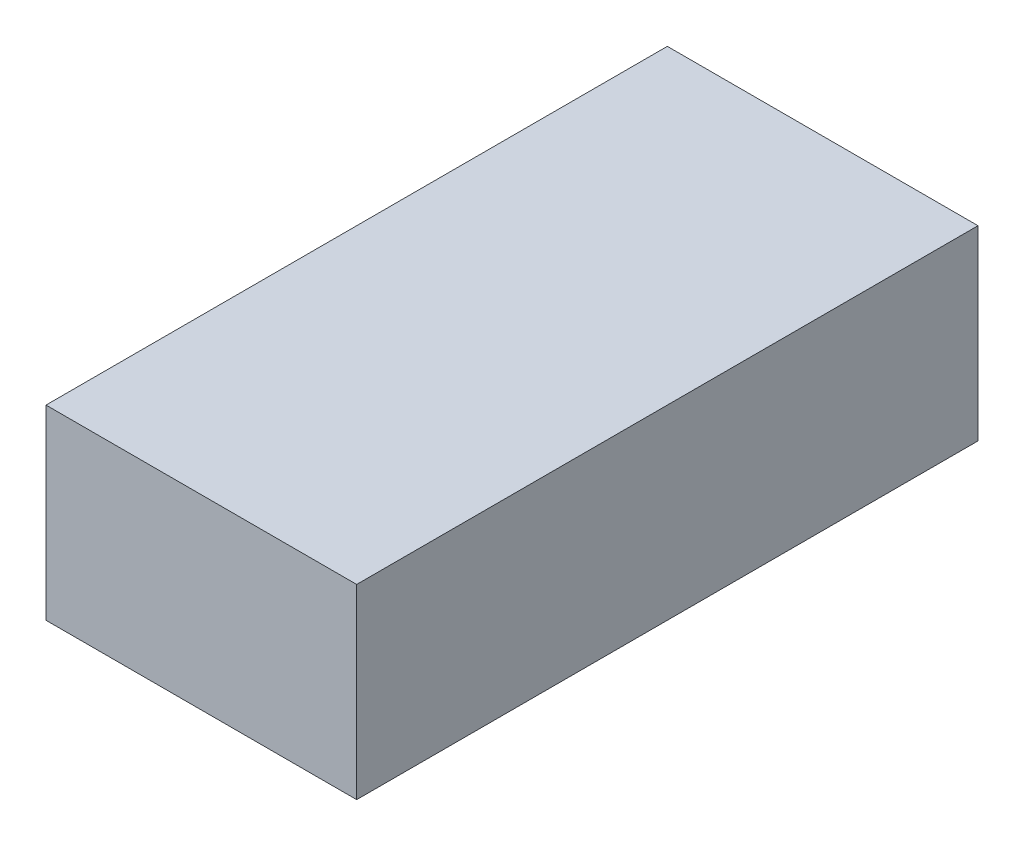
ISO-10303-21;
HEADER;
FILE_DESCRIPTION(('STEP AP214'),'2;1');
FILE_NAME('part.step','',(''),(''),'','','');
FILE_SCHEMA(('AUTOMOTIVE_DESIGN { 1 0 10303 214 1 1 1 1 }'));
ENDSEC;
DATA;
#1=APPLICATION_CONTEXT('core data for automotive mechanical design processes');
#2=APPLICATION_PROTOCOL_DEFINITION('international standard','automotive_design',2000,#1);
#3=PRODUCT_CONTEXT('',#1,'mechanical');
#4=PRODUCT('Part','Part','',(#3));
#5=PRODUCT_RELATED_PRODUCT_CATEGORY('part','',(#4));
#6=PRODUCT_DEFINITION_FORMATION('','',#4);
#7=PRODUCT_DEFINITION_CONTEXT('part definition',#1,'design');
#8=PRODUCT_DEFINITION('design','',#6,#7);
#9=PRODUCT_DEFINITION_SHAPE('','',#8);
#10=(LENGTH_UNIT() NAMED_UNIT(*) SI_UNIT(.MILLI.,.METRE.));
#11=(NAMED_UNIT(*) PLANE_ANGLE_UNIT() SI_UNIT($,.RADIAN.));
#12=(NAMED_UNIT(*) SI_UNIT($,.STERADIAN.) SOLID_ANGLE_UNIT());
#13=UNCERTAINTY_MEASURE_WITH_UNIT(LENGTH_MEASURE(1.E-05),#10,'distance_accuracy_value','');
#14=(GEOMETRIC_REPRESENTATION_CONTEXT(3) GLOBAL_UNCERTAINTY_ASSIGNED_CONTEXT((#13)) GLOBAL_UNIT_ASSIGNED_CONTEXT((#10,
#11,#12)) REPRESENTATION_CONTEXT('',''));
#15=CARTESIAN_POINT('',(0.,0.,0.));
#16=DIRECTION('',(0.,0.,1.));
#17=DIRECTION('',(1.,0.,0.));
#18=AXIS2_PLACEMENT_3D('',#15,#16,#17);
#19=CARTESIAN_POINT('',(2500.,-32.3,2272.51350251044));
#20=DIRECTION('',(0.,0.,-1.));
#21=DIRECTION('',(-1.,0.,0.));
#22=AXIS2_PLACEMENT_3D('',#19,#20,#21);
#23=PLANE('',#22);
#24=DIRECTION('',(0.,-1.,0.));
#25=VECTOR('',#24,1.);
#26=CARTESIAN_POINT('',(-2500.,-32.3,2272.51350251044));
#27=LINE('',#26,#25);
#28=CARTESIAN_POINT('',(-2500.,2967.7,2272.51350251044));
#29=VERTEX_POINT('',#28);
#30=CARTESIAN_POINT('',(-2500.,-32.3,2272.51350251044));
#31=VERTEX_POINT('',#30);
#32=EDGE_CURVE('E110',#29,#31,#27,.T.);
#33=ORIENTED_EDGE('',*,*,#32,.T.);
#34=DIRECTION('',(-1.,0.,0.));
#35=VECTOR('',#34,1.);
#36=CARTESIAN_POINT('',(2500.,-32.3,2272.51350251044));
#37=LINE('',#36,#35);
#38=CARTESIAN_POINT('',(2500.,-32.3,2272.51350251044));
#39=VERTEX_POINT('',#38);
#40=EDGE_CURVE('E12',#39,#31,#37,.T.);
#41=ORIENTED_EDGE('',*,*,#40,.F.);
#42=DIRECTION('',(0.,-1.,0.));
#43=VECTOR('',#42,1.);
#44=CARTESIAN_POINT('',(2500.,-32.3,2272.51350251044));
#45=LINE('',#44,#43);
#46=CARTESIAN_POINT('',(2500.,2967.7,2272.51350251044));
#47=VERTEX_POINT('',#46);
#48=EDGE_CURVE('E98',#47,#39,#45,.T.);
#49=ORIENTED_EDGE('',*,*,#48,.F.);
#50=DIRECTION('',(-1.,0.,0.));
#51=VECTOR('',#50,1.);
#52=CARTESIAN_POINT('',(2500.,2967.7,2272.51350251044));
#53=LINE('',#52,#51);
#54=EDGE_CURVE('E106',#47,#29,#53,.T.);
#55=ORIENTED_EDGE('',*,*,#54,.T.);
#56=EDGE_LOOP('',(#33,#41,#49,#55));
#57=FACE_BOUND('',#56,.T.);
#58=ADVANCED_FACE('F47',(#57),#23,.F.);
#59=CARTESIAN_POINT('',(2500.,-32.3,2272.51350251044));
#60=DIRECTION('',(0.,1.,0.));
#61=DIRECTION('',(0.,0.,1.));
#62=AXIS2_PLACEMENT_3D('',#59,#60,#61);
#63=PLANE('',#62);
#64=DIRECTION('',(0.,0.,-1.));
#65=VECTOR('',#64,1.);
#66=CARTESIAN_POINT('',(-2500.,-32.3,2272.51350251044));
#67=LINE('',#66,#65);
#68=CARTESIAN_POINT('',(-2500.,-32.3,-7727.48649748956));
#69=VERTEX_POINT('',#68);
#70=EDGE_CURVE('E102',#31,#69,#67,.T.);
#71=ORIENTED_EDGE('',*,*,#70,.T.);
#72=DIRECTION('',(-1.,0.,0.));
#73=VECTOR('',#72,1.);
#74=CARTESIAN_POINT('',(2500.,-32.3,-7727.48649748956));
#75=LINE('',#74,#73);
#76=CARTESIAN_POINT('',(2500.,-32.3,-7727.48649748956));
#77=VERTEX_POINT('',#76);
#78=EDGE_CURVE('E55',#77,#69,#75,.T.);
#79=ORIENTED_EDGE('',*,*,#78,.F.);
#80=DIRECTION('',(0.,0.,-1.));
#81=VECTOR('',#80,1.);
#82=CARTESIAN_POINT('',(2500.,-32.3,2272.51350251044));
#83=LINE('',#82,#81);
#84=EDGE_CURVE('E93',#39,#77,#83,.T.);
#85=ORIENTED_EDGE('',*,*,#84,.F.);
#86=ORIENTED_EDGE('',*,*,#40,.T.);
#87=EDGE_LOOP('',(#71,#79,#85,#86));
#88=FACE_BOUND('',#87,.T.);
#89=ADVANCED_FACE('F101',(#88),#63,.F.);
#90=CARTESIAN_POINT('',(2500.,-32.3,-7727.48649748956));
#91=DIRECTION('',(0.,0.,1.));
#92=DIRECTION('',(1.,0.,0.));
#93=AXIS2_PLACEMENT_3D('',#90,#91,#92);
#94=PLANE('',#93);
#95=DIRECTION('',(0.,1.,0.));
#96=VECTOR('',#95,1.);
#97=CARTESIAN_POINT('',(-2500.,-32.3,-7727.48649748956));
#98=LINE('',#97,#96);
#99=CARTESIAN_POINT('',(-2500.,2967.7,-7727.48649748956));
#100=VERTEX_POINT('',#99);
#101=EDGE_CURVE('E80',#69,#100,#98,.T.);
#102=ORIENTED_EDGE('',*,*,#101,.T.);
#103=DIRECTION('',(-1.,0.,0.));
#104=VECTOR('',#103,1.);
#105=CARTESIAN_POINT('',(2500.,2967.7,-7727.48649748956));
#106=LINE('',#105,#104);
#107=CARTESIAN_POINT('',(2500.,2967.7,-7727.48649748956));
#108=VERTEX_POINT('',#107);
#109=EDGE_CURVE('E103',#108,#100,#106,.T.);
#110=ORIENTED_EDGE('',*,*,#109,.F.);
#111=DIRECTION('',(0.,1.,0.));
#112=VECTOR('',#111,1.);
#113=CARTESIAN_POINT('',(2500.,-32.3,-7727.48649748956));
#114=LINE('',#113,#112);
#115=EDGE_CURVE('E96',#77,#108,#114,.T.);
#116=ORIENTED_EDGE('',*,*,#115,.F.);
#117=ORIENTED_EDGE('',*,*,#78,.T.);
#118=EDGE_LOOP('',(#102,#110,#116,#117));
#119=FACE_BOUND('',#118,.T.);
#120=ADVANCED_FACE('F104',(#119),#94,.F.);
#121=CARTESIAN_POINT('',(2500.,2967.7,2272.51350251044));
#122=DIRECTION('',(0.,-1.,0.));
#123=DIRECTION('',(0.,0.,-1.));
#124=AXIS2_PLACEMENT_3D('',#121,#122,#123);
#125=PLANE('',#124);
#126=DIRECTION('',(0.,0.,1.));
#127=VECTOR('',#126,1.);
#128=CARTESIAN_POINT('',(-2500.,2967.7,2272.51350251044));
#129=LINE('',#128,#127);
#130=EDGE_CURVE('E86',#100,#29,#129,.T.);
#131=ORIENTED_EDGE('',*,*,#130,.T.);
#132=ORIENTED_EDGE('',*,*,#54,.F.);
#133=DIRECTION('',(0.,0.,1.));
#134=VECTOR('',#133,1.);
#135=CARTESIAN_POINT('',(2500.,2967.7,2272.51350251044));
#136=LINE('',#135,#134);
#137=EDGE_CURVE('E63',#108,#47,#136,.T.);
#138=ORIENTED_EDGE('',*,*,#137,.F.);
#139=ORIENTED_EDGE('',*,*,#109,.T.);
#140=EDGE_LOOP('',(#131,#132,#138,#139));
#141=FACE_BOUND('',#140,.T.);
#142=ADVANCED_FACE('F117',(#141),#125,.F.);
#143=CARTESIAN_POINT('',(2500.,0.,0.));
#144=DIRECTION('',(-1.,0.,0.));
#145=DIRECTION('',(0.,0.,1.));
#146=AXIS2_PLACEMENT_3D('',#143,#144,#145);
#147=PLANE('',#146);
#148=ORIENTED_EDGE('',*,*,#48,.T.);
#149=ORIENTED_EDGE('',*,*,#84,.T.);
#150=ORIENTED_EDGE('',*,*,#115,.T.);
#151=ORIENTED_EDGE('',*,*,#137,.T.);
#152=EDGE_LOOP('',(#148,#149,#150,#151));
#153=FACE_BOUND('',#152,.T.);
#154=ADVANCED_FACE('F94',(#153),#147,.F.);
#155=CARTESIAN_POINT('',(-2500.,0.,0.));
#156=DIRECTION('',(-1.,0.,0.));
#157=DIRECTION('',(0.,0.,1.));
#158=AXIS2_PLACEMENT_3D('',#155,#156,#157);
#159=PLANE('',#158);
#160=ORIENTED_EDGE('',*,*,#32,.F.);
#161=ORIENTED_EDGE('',*,*,#130,.F.);
#162=ORIENTED_EDGE('',*,*,#101,.F.);
#163=ORIENTED_EDGE('',*,*,#70,.F.);
#164=EDGE_LOOP('',(#160,#161,#162,#163));
#165=FACE_BOUND('',#164,.T.);
#166=ADVANCED_FACE('F120',(#165),#159,.T.);
#167=CLOSED_SHELL('',(#58,#89,#120,#142,#154,#166));
#168=MANIFOLD_SOLID_BREP('B2_NOT_SHOWN',#167);
#169=CARTESIAN_POINT('',(69.,0.,0.));
#170=DIRECTION('',(0.,1.,0.));
#171=DIRECTION('',(0.,0.,1.));
#172=AXIS2_PLACEMENT_3D('',#169,#170,#171);
#173=PLANE('',#172);
#174=DIRECTION('',(-1.,0.,0.));
#175=VECTOR('',#174,1.);
#176=CARTESIAN_POINT('',(-48.6,0.,-92.6559396248703));
#177=LINE('',#176,#175);
#178=CARTESIAN_POINT('',(-48.6,0.,-92.6559396248703));
#179=VERTEX_POINT('',#178);
#180=CARTESIAN_POINT('',(-69.,0.,-92.6559396248703));
#181=VERTEX_POINT('',#180);
#182=EDGE_CURVE('E360',#179,#181,#177,.T.);
#183=ORIENTED_EDGE('',*,*,#182,.T.);
#184=DIRECTION('',(0.,0.,-1.));
#185=VECTOR('',#184,1.);
#186=CARTESIAN_POINT('',(-69.,0.,0.));
#187=LINE('',#186,#185);
#188=CARTESIAN_POINT('',(-69.,0.,-203.2));
#189=VERTEX_POINT('',#188);
#190=EDGE_CURVE('E344',#181,#189,#187,.T.);
#191=ORIENTED_EDGE('',*,*,#190,.T.);
#192=DIRECTION('',(-1.,0.,0.));
#193=VECTOR('',#192,1.);
#194=CARTESIAN_POINT('',(69.,0.,-203.2));
#195=LINE('',#194,#193);
#196=CARTESIAN_POINT('',(69.,0.,-203.2));
#197=VERTEX_POINT('',#196);
#198=EDGE_CURVE('E495',#197,#189,#195,.T.);
#199=ORIENTED_EDGE('',*,*,#198,.F.);
#200=DIRECTION('',(0.,0.,-1.));
#201=VECTOR('',#200,1.);
#202=CARTESIAN_POINT('',(69.,0.,262.79362659682));
#203=LINE('',#202,#201);
#204=CARTESIAN_POINT('',(69.,0.,-92.6559396248703));
#205=VERTEX_POINT('',#204);
#206=EDGE_CURVE('E444',#205,#197,#203,.T.);
#207=ORIENTED_EDGE('',*,*,#206,.F.);
#208=DIRECTION('',(1.,0.,0.));
#209=VECTOR('',#208,1.);
#210=CARTESIAN_POINT('',(48.6,0.,-92.6559396248703));
#211=LINE('',#210,#209);
#212=CARTESIAN_POINT('',(48.6,0.,-92.6559396248703));
#213=VERTEX_POINT('',#212);
#214=EDGE_CURVE('E397',#213,#205,#211,.T.);
#215=ORIENTED_EDGE('',*,*,#214,.F.);
#216=DIRECTION('',(0.,0.,1.));
#217=VECTOR('',#216,1.);
#218=CARTESIAN_POINT('',(48.6,0.,-28.0559396248703));
#219=LINE('',#218,#217);
#220=CARTESIAN_POINT('',(48.6,0.,-28.0559396248703));
#221=VERTEX_POINT('',#220);
#222=EDGE_CURVE('E394',#213,#221,#219,.T.);
#223=ORIENTED_EDGE('',*,*,#222,.T.);
#224=DIRECTION('',(1.,0.,0.));
#225=VECTOR('',#224,1.);
#226=CARTESIAN_POINT('',(48.6,0.,-28.0559396248703));
#227=LINE('',#226,#225);
#228=CARTESIAN_POINT('',(69.,0.,-28.0559396248703));
#229=VERTEX_POINT('',#228);
#230=EDGE_CURVE('E399',#221,#229,#227,.T.);
#231=ORIENTED_EDGE('',*,*,#230,.T.);
#232=CARTESIAN_POINT('',(69.,0.,160.34406037513));
#233=VERTEX_POINT('',#232);
#234=EDGE_CURVE('E450',#233,#229,#203,.T.);
#235=ORIENTED_EDGE('',*,*,#234,.F.);
#236=DIRECTION('',(1.,0.,0.));
#237=VECTOR('',#236,1.);
#238=CARTESIAN_POINT('',(48.6,0.,160.34406037513));
#239=LINE('',#238,#237);
#240=CARTESIAN_POINT('',(48.6,0.,160.34406037513));
#241=VERTEX_POINT('',#240);
#242=EDGE_CURVE('E410',#241,#233,#239,.T.);
#243=ORIENTED_EDGE('',*,*,#242,.F.);
#244=DIRECTION('',(0.,0.,1.));
#245=VECTOR('',#244,1.);
#246=CARTESIAN_POINT('',(48.6,0.,224.94406037513));
#247=LINE('',#246,#245);
#248=CARTESIAN_POINT('',(48.6,0.,224.94406037513));
#249=VERTEX_POINT('',#248);
#250=EDGE_CURVE('E407',#241,#249,#247,.T.);
#251=ORIENTED_EDGE('',*,*,#250,.T.);
#252=DIRECTION('',(1.,0.,0.));
#253=VECTOR('',#252,1.);
#254=CARTESIAN_POINT('',(48.6,0.,224.94406037513));
#255=LINE('',#254,#253);
#256=CARTESIAN_POINT('',(69.,0.,224.94406037513));
#257=VERTEX_POINT('',#256);
#258=EDGE_CURVE('E412',#249,#257,#255,.T.);
#259=ORIENTED_EDGE('',*,*,#258,.T.);
#260=CARTESIAN_POINT('',(69.,0.,262.79362659682));
#261=VERTEX_POINT('',#260);
#262=EDGE_CURVE('E446',#261,#257,#203,.T.);
#263=ORIENTED_EDGE('',*,*,#262,.F.);
#264=DIRECTION('',(-1.,0.,0.));
#265=VECTOR('',#264,1.);
#266=CARTESIAN_POINT('',(69.,0.,262.79362659682));
#267=LINE('',#266,#265);
#268=CARTESIAN_POINT('',(-69.,0.,262.79362659682));
#269=VERTEX_POINT('',#268);
#270=EDGE_CURVE('E497',#261,#269,#267,.T.);
#271=ORIENTED_EDGE('',*,*,#270,.T.);
#272=CARTESIAN_POINT('',(-69.,0.,224.94406037513));
#273=VERTEX_POINT('',#272);
#274=EDGE_CURVE('E358',#269,#273,#187,.T.);
#275=ORIENTED_EDGE('',*,*,#274,.T.);
#276=DIRECTION('',(-1.,0.,0.));
#277=VECTOR('',#276,1.);
#278=CARTESIAN_POINT('',(-48.6,0.,224.94406037513));
#279=LINE('',#278,#277);
#280=CARTESIAN_POINT('',(-48.6,0.,224.94406037513));
#281=VERTEX_POINT('',#280);
#282=EDGE_CURVE('E383',#281,#273,#279,.T.);
#283=ORIENTED_EDGE('',*,*,#282,.F.);
#284=DIRECTION('',(0.,0.,1.));
#285=VECTOR('',#284,1.);
#286=CARTESIAN_POINT('',(-48.6,0.,224.94406037513));
#287=LINE('',#286,#285);
#288=CARTESIAN_POINT('',(-48.6,0.,160.34406037513));
#289=VERTEX_POINT('',#288);
#290=EDGE_CURVE('E380',#289,#281,#287,.T.);
#291=ORIENTED_EDGE('',*,*,#290,.F.);
#292=DIRECTION('',(-1.,0.,0.));
#293=VECTOR('',#292,1.);
#294=CARTESIAN_POINT('',(-48.6,0.,160.34406037513));
#295=LINE('',#294,#293);
#296=CARTESIAN_POINT('',(-69.,0.,160.34406037513));
#297=VERTEX_POINT('',#296);
#298=EDGE_CURVE('E386',#289,#297,#295,.T.);
#299=ORIENTED_EDGE('',*,*,#298,.T.);
#300=CARTESIAN_POINT('',(-69.,0.,-28.0559396248702));
#301=VERTEX_POINT('',#300);
#302=EDGE_CURVE('E355',#297,#301,#187,.T.);
#303=ORIENTED_EDGE('',*,*,#302,.T.);
#304=DIRECTION('',(-1.,0.,0.));
#305=VECTOR('',#304,1.);
#306=CARTESIAN_POINT('',(-48.6,0.,-28.0559396248703));
#307=LINE('',#306,#305);
#308=CARTESIAN_POINT('',(-48.6,0.,-28.0559396248703));
#309=VERTEX_POINT('',#308);
#310=EDGE_CURVE('E367',#309,#301,#307,.T.);
#311=ORIENTED_EDGE('',*,*,#310,.F.);
#312=DIRECTION('',(0.,0.,1.));
#313=VECTOR('',#312,1.);
#314=CARTESIAN_POINT('',(-48.6,0.,-28.0559396248703));
#315=LINE('',#314,#313);
#316=EDGE_CURVE('E362',#179,#309,#315,.T.);
#317=ORIENTED_EDGE('',*,*,#316,.F.);
#318=EDGE_LOOP('',(#183,#191,#199,#207,#215,#223,#231,#235,#243,#251,#259,#263,#271,#275,#283,
#291,#299,#303,#311,#317));
#319=FACE_BOUND('',#318,.T.);
#320=ADVANCED_FACE('F171',(#319),#173,.F.);
#321=CARTESIAN_POINT('',(69.,81.9,-188.2));
#322=DIRECTION('',(0.,0.,-1.));
#323=DIRECTION('',(-1.,0.,0.));
#324=AXIS2_PLACEMENT_3D('',#321,#322,#323);
#325=PLANE('',#324);
#326=DIRECTION('',(-1.,0.,0.));
#327=VECTOR('',#326,1.);
#328=CARTESIAN_POINT('',(69.,81.9,-188.2));
#329=LINE('',#328,#327);
#330=CARTESIAN_POINT('',(54.,81.9,-188.2));
#331=VERTEX_POINT('',#330);
#332=CARTESIAN_POINT('',(-54.,81.9,-188.2));
#333=VERTEX_POINT('',#332);
#334=EDGE_CURVE('E490',#331,#333,#329,.T.);
#335=ORIENTED_EDGE('',*,*,#334,.T.);
#336=DIRECTION('',(0.,-1.,0.));
#337=VECTOR('',#336,1.);
#338=CARTESIAN_POINT('',(-54.,270.696822007152,-188.2));
#339=LINE('',#338,#337);
#340=CARTESIAN_POINT('',(-54.,20.,-188.2));
#341=VERTEX_POINT('',#340);
#342=EDGE_CURVE('E427',#333,#341,#339,.T.);
#343=ORIENTED_EDGE('',*,*,#342,.T.);
#344=DIRECTION('',(-1.,0.,0.));
#345=VECTOR('',#344,1.);
#346=CARTESIAN_POINT('',(69.,20.,-188.2));
#347=LINE('',#346,#345);
#348=CARTESIAN_POINT('',(54.,20.,-188.2));
#349=VERTEX_POINT('',#348);
#350=EDGE_CURVE('E487',#349,#341,#347,.T.);
#351=ORIENTED_EDGE('',*,*,#350,.F.);
#352=DIRECTION('',(0.,-1.,0.));
#353=VECTOR('',#352,1.);
#354=CARTESIAN_POINT('',(54.,270.696822007152,-188.2));
#355=LINE('',#354,#353);
#356=EDGE_CURVE('E438',#331,#349,#355,.T.);
#357=ORIENTED_EDGE('',*,*,#356,.F.);
#358=EDGE_LOOP('',(#335,#343,#351,#357));
#359=FACE_BOUND('',#358,.T.);
#360=ADVANCED_FACE('F612',(#359),#325,.F.);
#361=CARTESIAN_POINT('',(69.,20.,-188.2));
#362=DIRECTION('',(0.,-1.,0.));
#363=DIRECTION('',(0.,0.,-1.));
#364=AXIS2_PLACEMENT_3D('',#361,#362,#363);
#365=PLANE('',#364);
#366=ORIENTED_EDGE('',*,*,#350,.T.);
#367=DIRECTION('',(0.,0.,1.));
#368=VECTOR('',#367,1.);
#369=CARTESIAN_POINT('',(-54.,20.,0.));
#370=LINE('',#369,#368);
#371=CARTESIAN_POINT('',(-54.,20.,0.));
#372=VERTEX_POINT('',#371);
#373=EDGE_CURVE('E415',#341,#372,#370,.T.);
#374=ORIENTED_EDGE('',*,*,#373,.T.);
#375=DIRECTION('',(-1.,0.,0.));
#376=VECTOR('',#375,1.);
#377=CARTESIAN_POINT('',(69.,20.,0.));
#378=LINE('',#377,#376);
#379=CARTESIAN_POINT('',(54.,20.,0.));
#380=VERTEX_POINT('',#379);
#381=EDGE_CURVE('E467',#380,#372,#378,.T.);
#382=ORIENTED_EDGE('',*,*,#381,.F.);
#383=DIRECTION('',(0.,0.,1.));
#384=VECTOR('',#383,1.);
#385=CARTESIAN_POINT('',(54.,20.,0.));
#386=LINE('',#385,#384);
#387=EDGE_CURVE('E425',#349,#380,#386,.T.);
#388=ORIENTED_EDGE('',*,*,#387,.F.);
#389=EDGE_LOOP('',(#366,#374,#382,#388));
#390=FACE_BOUND('',#389,.T.);
#391=ADVANCED_FACE('F617',(#390),#365,.F.);
#392=CARTESIAN_POINT('',(69.,20.,0.));
#393=DIRECTION('',(0.,0.,1.));
#394=DIRECTION('',(1.,0.,0.));
#395=AXIS2_PLACEMENT_3D('',#392,#393,#394);
#396=PLANE('',#395);
#397=DIRECTION('',(0.,1.,0.));
#398=VECTOR('',#397,1.);
#399=CARTESIAN_POINT('',(-69.,20.,0.));
#400=LINE('',#399,#398);
#401=CARTESIAN_POINT('',(-69.,81.9000000000001,0.));
#402=VERTEX_POINT('',#401);
#403=CARTESIAN_POINT('',(-69.,123.7,0.));
#404=VERTEX_POINT('',#403);
#405=EDGE_CURVE('E472',#402,#404,#400,.T.);
#406=ORIENTED_EDGE('',*,*,#405,.T.);
#407=DIRECTION('',(-1.,0.,0.));
#408=VECTOR('',#407,1.);
#409=CARTESIAN_POINT('',(69.,123.7,0.));
#410=LINE('',#409,#408);
#411=CARTESIAN_POINT('',(69.,123.7,0.));
#412=VERTEX_POINT('',#411);
#413=EDGE_CURVE('E519',#404,#412,#410,.F.);
#414=ORIENTED_EDGE('',*,*,#413,.T.);
#415=DIRECTION('',(0.,1.,0.));
#416=VECTOR('',#415,1.);
#417=CARTESIAN_POINT('',(69.,20.,0.));
#418=LINE('',#417,#416);
#419=CARTESIAN_POINT('',(69.,81.9000000000002,0.));
#420=VERTEX_POINT('',#419);
#421=EDGE_CURVE('E454',#420,#412,#418,.T.);
#422=ORIENTED_EDGE('',*,*,#421,.F.);
#423=DIRECTION('',(-1.,0.,0.));
#424=VECTOR('',#423,1.);
#425=CARTESIAN_POINT('',(69.,81.9000000000002,0.));
#426=LINE('',#425,#424);
#427=CARTESIAN_POINT('',(54.,81.9000000000002,0.));
#428=VERTEX_POINT('',#427);
#429=EDGE_CURVE('E433',#420,#428,#426,.T.);
#430=ORIENTED_EDGE('',*,*,#429,.T.);
#431=DIRECTION('',(0.,-1.,0.));
#432=VECTOR('',#431,1.);
#433=CARTESIAN_POINT('',(54.,270.696822007151,0.));
#434=LINE('',#433,#432);
#435=EDGE_CURVE('E435',#428,#380,#434,.T.);
#436=ORIENTED_EDGE('',*,*,#435,.T.);
#437=ORIENTED_EDGE('',*,*,#381,.T.);
#438=DIRECTION('',(0.,-1.,0.));
#439=VECTOR('',#438,1.);
#440=CARTESIAN_POINT('',(-54.,270.696822007151,0.));
#441=LINE('',#440,#439);
#442=CARTESIAN_POINT('',(-54.,81.9000000000002,0.));
#443=VERTEX_POINT('',#442);
#444=EDGE_CURVE('E422',#443,#372,#441,.T.);
#445=ORIENTED_EDGE('',*,*,#444,.F.);
#446=DIRECTION('',(1.,0.,0.));
#447=VECTOR('',#446,1.);
#448=CARTESIAN_POINT('',(-69.,81.9000000000002,0.));
#449=LINE('',#448,#447);
#450=EDGE_CURVE('E421',#402,#443,#449,.T.);
#451=ORIENTED_EDGE('',*,*,#450,.F.);
#452=EDGE_LOOP('',(#406,#414,#422,#430,#436,#437,#445,#451));
#453=FACE_BOUND('',#452,.T.);
#454=ADVANCED_FACE('F625',(#453),#396,.F.);
#455=CARTESIAN_POINT('',(69.,15.7395723137565,255.14406037513));
#456=DIRECTION('',(-1.,0.,0.));
#457=DIRECTION('',(0.,0.,1.));
#458=AXIS2_PLACEMENT_3D('',#455,#456,#457);
#459=CYLINDRICAL_SURFACE('',#458,17.5);
#460=CARTESIAN_POINT('',(69.,15.7395723137565,255.14406037513));
#461=DIRECTION('',(1.,0.,0.));
#462=DIRECTION('',(0.,0.,-1.));
#463=AXIS2_PLACEMENT_3D('',#460,#461,#462);
#464=CIRCLE('',#463,17.5);
#465=CARTESIAN_POINT('',(69.,29.1597981364929,266.375602516206));
#466=VERTEX_POINT('',#465);
#467=EDGE_CURVE('E442',#466,#261,#464,.T.);
#468=ORIENTED_EDGE('',*,*,#467,.F.);
#469=DIRECTION('',(-1.,0.,0.));
#470=VECTOR('',#469,1.);
#471=CARTESIAN_POINT('',(69.,29.1597981364929,266.375602516206));
#472=LINE('',#471,#470);
#473=CARTESIAN_POINT('',(-69.,29.1597981364929,266.375602516206));
#474=VERTEX_POINT('',#473);
#475=EDGE_CURVE('E500',#466,#474,#472,.T.);
#476=ORIENTED_EDGE('',*,*,#475,.T.);
#477=CARTESIAN_POINT('',(-69.,15.7395723137565,255.14406037513));
#478=DIRECTION('',(1.,0.,0.));
#479=DIRECTION('',(0.,0.,-1.));
#480=AXIS2_PLACEMENT_3D('',#477,#478,#479);
#481=CIRCLE('',#480,17.5);
#482=EDGE_CURVE('E356',#474,#269,#481,.T.);
#483=ORIENTED_EDGE('',*,*,#482,.T.);
#484=ORIENTED_EDGE('',*,*,#270,.F.);
#485=EDGE_LOOP('',(#468,#476,#483,#484));
#486=FACE_BOUND('',#485,.T.);
#487=ADVANCED_FACE('F567',(#486),#459,.T.);
#488=CARTESIAN_POINT('',(69.,0.,-203.2));
#489=DIRECTION('',(0.,0.,1.));
#490=DIRECTION('',(1.,0.,0.));
#491=AXIS2_PLACEMENT_3D('',#488,#489,#490);
#492=PLANE('',#491);
#493=DIRECTION('',(0.,1.,0.));
#494=VECTOR('',#493,1.);
#495=CARTESIAN_POINT('',(-69.,0.,-203.2));
#496=LINE('',#495,#494);
#497=CARTESIAN_POINT('',(-69.,81.9,-203.2));
#498=VERTEX_POINT('',#497);
#499=EDGE_CURVE('E351',#189,#498,#496,.T.);
#500=ORIENTED_EDGE('',*,*,#499,.T.);
#501=DIRECTION('',(-1.,0.,0.));
#502=VECTOR('',#501,1.);
#503=CARTESIAN_POINT('',(69.,81.9,-203.2));
#504=LINE('',#503,#502);
#505=CARTESIAN_POINT('',(69.,81.9,-203.2));
#506=VERTEX_POINT('',#505);
#507=EDGE_CURVE('E492',#506,#498,#504,.T.);
#508=ORIENTED_EDGE('',*,*,#507,.F.);
#509=DIRECTION('',(0.,1.,0.));
#510=VECTOR('',#509,1.);
#511=CARTESIAN_POINT('',(69.,0.,-203.2));
#512=LINE('',#511,#510);
#513=EDGE_CURVE('E449',#197,#506,#512,.T.);
#514=ORIENTED_EDGE('',*,*,#513,.F.);
#515=ORIENTED_EDGE('',*,*,#198,.T.);
#516=EDGE_LOOP('',(#500,#508,#514,#515));
#517=FACE_BOUND('',#516,.T.);
#518=ADVANCED_FACE('F584',(#517),#492,.F.);
#519=CARTESIAN_POINT('',(69.,81.9,-203.2));
#520=DIRECTION('',(0.,-1.,0.));
#521=DIRECTION('',(0.,0.,-1.));
#522=AXIS2_PLACEMENT_3D('',#519,#520,#521);
#523=PLANE('',#522);
#524=DIRECTION('',(0.,0.,1.));
#525=VECTOR('',#524,1.);
#526=CARTESIAN_POINT('',(-69.,81.9,-203.2));
#527=LINE('',#526,#525);
#528=EDGE_CURVE('E470',#498,#402,#527,.T.);
#529=ORIENTED_EDGE('',*,*,#528,.T.);
#530=ORIENTED_EDGE('',*,*,#450,.T.);
#531=DIRECTION('',(0.,0.,-1.));
#532=VECTOR('',#531,1.);
#533=CARTESIAN_POINT('',(-54.,81.9000000000002,2.04779788736128E-13));
#534=LINE('',#533,#532);
#535=EDGE_CURVE('E418',#443,#333,#534,.T.);
#536=ORIENTED_EDGE('',*,*,#535,.T.);
#537=ORIENTED_EDGE('',*,*,#334,.F.);
#538=DIRECTION('',(0.,0.,-1.));
#539=VECTOR('',#538,1.);
#540=CARTESIAN_POINT('',(54.,81.9000000000002,2.04779788736128E-13));
#541=LINE('',#540,#539);
#542=EDGE_CURVE('E431',#428,#331,#541,.T.);
#543=ORIENTED_EDGE('',*,*,#542,.F.);
#544=ORIENTED_EDGE('',*,*,#429,.F.);
#545=DIRECTION('',(0.,0.,1.));
#546=VECTOR('',#545,1.);
#547=CARTESIAN_POINT('',(69.,81.9,-203.2));
#548=LINE('',#547,#546);
#549=EDGE_CURVE('E452',#506,#420,#548,.T.);
#550=ORIENTED_EDGE('',*,*,#549,.F.);
#551=ORIENTED_EDGE('',*,*,#507,.T.);
#552=EDGE_LOOP('',(#529,#530,#536,#537,#543,#544,#550,#551));
#553=FACE_BOUND('',#552,.T.);
#554=ADVANCED_FACE('F588',(#553),#523,.F.);
#555=CARTESIAN_POINT('',(69.,133.7,0.));
#556=DIRECTION('',(0.,-1.,0.));
#557=DIRECTION('',(0.,0.,-1.));
#558=AXIS2_PLACEMENT_3D('',#555,#556,#557);
#559=PLANE('',#558);
#560=DIRECTION('',(0.,0.,1.));
#561=VECTOR('',#560,1.);
#562=CARTESIAN_POINT('',(69.,133.7,0.));
#563=LINE('',#562,#561);
#564=CARTESIAN_POINT('',(69.,133.7,10.));
#565=VERTEX_POINT('',#564);
#566=CARTESIAN_POINT('',(69.,133.7,111.84701211121));
#567=VERTEX_POINT('',#566);
#568=EDGE_CURVE('E457',#565,#567,#563,.T.);
#569=ORIENTED_EDGE('',*,*,#568,.F.);
#570=DIRECTION('',(-1.,0.,0.));
#571=VECTOR('',#570,1.);
#572=CARTESIAN_POINT('',(69.,133.7,10.));
#573=LINE('',#572,#571);
#574=CARTESIAN_POINT('',(-69.,133.7,10.));
#575=VERTEX_POINT('',#574);
#576=EDGE_CURVE('E510',#565,#575,#573,.T.);
#577=ORIENTED_EDGE('',*,*,#576,.T.);
#578=DIRECTION('',(0.,0.,1.));
#579=VECTOR('',#578,1.);
#580=CARTESIAN_POINT('',(-69.,133.7,0.));
#581=LINE('',#580,#579);
#582=CARTESIAN_POINT('',(-69.,133.7,111.84701211121));
#583=VERTEX_POINT('',#582);
#584=EDGE_CURVE('E475',#575,#583,#581,.T.);
#585=ORIENTED_EDGE('',*,*,#584,.T.);
#586=DIRECTION('',(-1.,0.,0.));
#587=VECTOR('',#586,1.);
#588=CARTESIAN_POINT('',(69.,133.7,111.84701211121));
#589=LINE('',#588,#587);
#590=EDGE_CURVE('E508',#583,#567,#589,.F.);
#591=ORIENTED_EDGE('',*,*,#590,.T.);
#592=EDGE_LOOP('',(#569,#577,#585,#591));
#593=FACE_BOUND('',#592,.T.);
#594=ADVANCED_FACE('F598',(#593),#559,.F.);
#595=CARTESIAN_POINT('',(69.,133.7,115.));
#596=DIRECTION('',(0.,-0.819152044288995,-0.573576436351042));
#597=DIRECTION('',(0.,0.573576436351042,-0.819152044288995));
#598=AXIS2_PLACEMENT_3D('',#595,#596,#597);
#599=PLANE('',#598);
#600=DIRECTION('',(0.,-0.573576436351042,0.819152044288994));
#601=VECTOR('',#600,1.);
#602=CARTESIAN_POINT('',(69.,133.7,115.));
#603=LINE('',#602,#601);
#604=CARTESIAN_POINT('',(69.,131.89152044289,117.582776474721));
#605=VERTEX_POINT('',#604);
#606=CARTESIAN_POINT('',(69.,95.7296916570861,169.227220175317));
#607=VERTEX_POINT('',#606);
#608=EDGE_CURVE('E460',#605,#607,#603,.T.);
#609=ORIENTED_EDGE('',*,*,#608,.F.);
#610=DIRECTION('',(-1.,0.,0.));
#611=VECTOR('',#610,1.);
#612=CARTESIAN_POINT('',(69.,131.89152044289,117.582776474721));
#613=LINE('',#612,#611);
#614=CARTESIAN_POINT('',(-69.,131.89152044289,117.582776474721));
#615=VERTEX_POINT('',#614);
#616=EDGE_CURVE('E529',#605,#615,#613,.T.);
#617=ORIENTED_EDGE('',*,*,#616,.T.);
#618=DIRECTION('',(0.,-0.573576436351042,0.819152044288994));
#619=VECTOR('',#618,1.);
#620=CARTESIAN_POINT('',(-69.,133.7,115.));
#621=LINE('',#620,#619);
#622=CARTESIAN_POINT('',(-69.,95.7296916570861,169.227220175317));
#623=VERTEX_POINT('',#622);
#624=EDGE_CURVE('E478',#615,#623,#621,.T.);
#625=ORIENTED_EDGE('',*,*,#624,.T.);
#626=DIRECTION('',(-1.,0.,0.));
#627=VECTOR('',#626,1.);
#628=CARTESIAN_POINT('',(69.,95.7296916570861,169.227220175317));
#629=LINE('',#628,#627);
#630=EDGE_CURVE('E527',#623,#607,#629,.F.);
#631=ORIENTED_EDGE('',*,*,#630,.T.);
#632=EDGE_LOOP('',(#609,#617,#625,#631));
#633=FACE_BOUND('',#632,.T.);
#634=ADVANCED_FACE('F546',(#633),#599,.F.);
#635=CARTESIAN_POINT('',(69.,94.3526564663185,171.193830238225));
#636=DIRECTION('',(0.,-0.990268068741571,-0.139173100960059));
#637=DIRECTION('',(0.,0.139173100960059,-0.990268068741571));
#638=AXIS2_PLACEMENT_3D('',#635,#636,#637);
#639=PLANE('',#638);
#640=DIRECTION('',(0.,-0.139173100960059,0.990268068741571));
#641=VECTOR('',#640,1.);
#642=CARTESIAN_POINT('',(69.,94.3526564663185,171.193830238225));
#643=LINE('',#642,#641);
#644=CARTESIAN_POINT('',(69.,94.0185314125603,173.571253529226));
#645=VERTEX_POINT('',#644);
#646=CARTESIAN_POINT('',(69.,82.6889579367665,254.185357606421));
#647=VERTEX_POINT('',#646);
#648=EDGE_CURVE('E462',#645,#647,#643,.T.);
#649=ORIENTED_EDGE('',*,*,#648,.F.);
#650=DIRECTION('',(-1.,0.,0.));
#651=VECTOR('',#650,1.);
#652=CARTESIAN_POINT('',(-69.,94.0185314125603,173.571253529226));
#653=LINE('',#652,#651);
#654=CARTESIAN_POINT('',(-69.,94.0185314125603,173.571253529226));
#655=VERTEX_POINT('',#654);
#656=EDGE_CURVE('E533',#645,#655,#653,.T.);
#657=ORIENTED_EDGE('',*,*,#656,.T.);
#658=DIRECTION('',(0.,-0.139173100960059,0.990268068741571));
#659=VECTOR('',#658,1.);
#660=CARTESIAN_POINT('',(-69.,94.3526564663185,171.193830238225));
#661=LINE('',#660,#659);
#662=CARTESIAN_POINT('',(-69.,82.6889579367665,254.185357606421));
#663=VERTEX_POINT('',#662);
#664=EDGE_CURVE('E481',#655,#663,#661,.T.);
#665=ORIENTED_EDGE('',*,*,#664,.T.);
#666=DIRECTION('',(-1.,0.,0.));
#667=VECTOR('',#666,1.);
#668=CARTESIAN_POINT('',(69.,82.6889579367665,254.185357606421));
#669=LINE('',#668,#667);
#670=EDGE_CURVE('E186',#663,#647,#669,.F.);
#671=ORIENTED_EDGE('',*,*,#670,.T.);
#672=EDGE_LOOP('',(#649,#657,#665,#671));
#673=FACE_BOUND('',#672,.T.);
#674=ADVANCED_FACE('F549',(#673),#639,.F.);
#675=CARTESIAN_POINT('',(69.,81.4791446275131,262.79362659682));
#676=DIRECTION('',(0.,0.,-1.));
#677=DIRECTION('',(0.,1.,0.));
#678=AXIS2_PLACEMENT_3D('',#675,#676,#677);
#679=PLANE('',#678);
#680=DIRECTION('',(0.,-1.,0.));
#681=VECTOR('',#680,1.);
#682=CARTESIAN_POINT('',(-69.,81.4791446275131,262.79362659682));
#683=LINE('',#682,#681);
#684=CARTESIAN_POINT('',(-69.,72.7862772493507,262.79362659682));
#685=VERTEX_POINT('',#684);
#686=CARTESIAN_POINT('',(-69.,36.8284986066279,262.79362659682));
#687=VERTEX_POINT('',#686);
#688=EDGE_CURVE('E445',#685,#687,#683,.T.);
#689=ORIENTED_EDGE('',*,*,#688,.T.);
#690=DIRECTION('',(1.,0.,0.));
#691=VECTOR('',#690,1.);
#692=CARTESIAN_POINT('',(69.,36.8284986066279,262.79362659682));
#693=LINE('',#692,#691);
#694=CARTESIAN_POINT('',(69.,36.8284986066279,262.79362659682));
#695=VERTEX_POINT('',#694);
#696=EDGE_CURVE('E506',#687,#695,#693,.T.);
#697=ORIENTED_EDGE('',*,*,#696,.T.);
#698=DIRECTION('',(0.,-1.,0.));
#699=VECTOR('',#698,1.);
#700=CARTESIAN_POINT('',(69.,81.4791446275131,262.79362659682));
#701=LINE('',#700,#699);
#702=CARTESIAN_POINT('',(69.,72.7862772493507,262.79362659682));
#703=VERTEX_POINT('',#702);
#704=EDGE_CURVE('E464',#703,#695,#701,.T.);
#705=ORIENTED_EDGE('',*,*,#704,.F.);
#706=DIRECTION('',(-1.,0.,0.));
#707=VECTOR('',#706,1.);
#708=CARTESIAN_POINT('',(69.,72.7862772493507,262.79362659682));
#709=LINE('',#708,#707);
#710=EDGE_CURVE('E503',#703,#685,#709,.T.);
#711=ORIENTED_EDGE('',*,*,#710,.T.);
#712=EDGE_LOOP('',(#689,#697,#705,#711));
#713=FACE_BOUND('',#712,.T.);
#714=ADVANCED_FACE('F557',(#713),#679,.F.);
#715=CARTESIAN_POINT('',(69.,15.7395723137565,255.14406037513));
#716=DIRECTION('',(1.,0.,0.));
#717=DIRECTION('',(0.,0.,-1.));
#718=AXIS2_PLACEMENT_3D('',#715,#716,#717);
#719=PLANE('',#718);
#720=ORIENTED_EDGE('',*,*,#421,.T.);
#721=CARTESIAN_POINT('',(69.,123.7,10.));
#722=DIRECTION('',(1.,0.,0.));
#723=DIRECTION('',(0.,0.,-1.));
#724=AXIS2_PLACEMENT_3D('',#721,#722,#723);
#725=CIRCLE('',#724,10.);
#726=EDGE_CURVE('E525',#412,#565,#725,.T.);
#727=ORIENTED_EDGE('',*,*,#726,.T.);
#728=ORIENTED_EDGE('',*,*,#568,.T.);
#729=CARTESIAN_POINT('',(69.,123.7,111.84701211121));
#730=DIRECTION('',(1.,0.,0.));
#731=DIRECTION('',(0.,0.,-1.));
#732=AXIS2_PLACEMENT_3D('',#729,#730,#731);
#733=CIRCLE('',#732,10.);
#734=EDGE_CURVE('E523',#567,#605,#733,.T.);
#735=ORIENTED_EDGE('',*,*,#734,.T.);
#736=ORIENTED_EDGE('',*,*,#608,.T.);
#737=CARTESIAN_POINT('',(69.,103.921212099976,174.962984538827));
#738=DIRECTION('',(1.,0.,0.));
#739=DIRECTION('',(0.,0.,-1.));
#740=AXIS2_PLACEMENT_3D('',#737,#738,#739);
#741=CIRCLE('',#740,10.);
#742=EDGE_CURVE('E45',#607,#645,#741,.F.);
#743=ORIENTED_EDGE('',*,*,#742,.T.);
#744=ORIENTED_EDGE('',*,*,#648,.T.);
#745=CARTESIAN_POINT('',(69.,72.7862772493507,252.79362659682));
#746=DIRECTION('',(1.,0.,0.));
#747=DIRECTION('',(0.,0.,-1.));
#748=AXIS2_PLACEMENT_3D('',#745,#746,#747);
#749=CIRCLE('',#748,10.);
#750=EDGE_CURVE('E521',#647,#703,#749,.T.);
#751=ORIENTED_EDGE('',*,*,#750,.T.);
#752=ORIENTED_EDGE('',*,*,#704,.T.);
#753=CARTESIAN_POINT('',(69.,36.8284986066279,272.79362659682));
#754=DIRECTION('',(1.,0.,0.));
#755=DIRECTION('',(0.,0.,-1.));
#756=AXIS2_PLACEMENT_3D('',#753,#754,#755);
#757=CIRCLE('',#756,10.);
#758=EDGE_CURVE('E538',#695,#466,#757,.F.);
#759=ORIENTED_EDGE('',*,*,#758,.T.);
#760=ORIENTED_EDGE('',*,*,#467,.T.);
#761=ORIENTED_EDGE('',*,*,#262,.T.);
#762=CARTESIAN_POINT('',(69.,0.,192.64406037513));
#763=DIRECTION('',(1.,0.,0.));
#764=DIRECTION('',(0.,0.,-1.));
#765=AXIS2_PLACEMENT_3D('',#762,#763,#764);
#766=CIRCLE('',#765,32.3);
#767=EDGE_CURVE('E402',#257,#233,#766,.T.);
#768=ORIENTED_EDGE('',*,*,#767,.T.);
#769=ORIENTED_EDGE('',*,*,#234,.T.);
#770=CARTESIAN_POINT('',(69.,0.,-60.3559396248703));
#771=DIRECTION('',(1.,0.,0.));
#772=DIRECTION('',(0.,0.,-1.));
#773=AXIS2_PLACEMENT_3D('',#770,#771,#772);
#774=CIRCLE('',#773,32.3);
#775=EDGE_CURVE('E389',#229,#205,#774,.T.);
#776=ORIENTED_EDGE('',*,*,#775,.T.);
#777=ORIENTED_EDGE('',*,*,#206,.T.);
#778=ORIENTED_EDGE('',*,*,#513,.T.);
#779=ORIENTED_EDGE('',*,*,#549,.T.);
#780=EDGE_LOOP('',(#720,#727,#728,#735,#736,#743,#744,#751,#752,#759,#760,#761,#768,#769,#776,
#777,#778,#779));
#781=FACE_BOUND('',#780,.T.);
#782=ADVANCED_FACE('F551',(#781),#719,.T.);
#783=CARTESIAN_POINT('',(-69.,15.7395723137565,255.14406037513));
#784=DIRECTION('',(1.,0.,0.));
#785=DIRECTION('',(0.,0.,-1.));
#786=AXIS2_PLACEMENT_3D('',#783,#784,#785);
#787=PLANE('',#786);
#788=ORIENTED_EDGE('',*,*,#584,.F.);
#789=CARTESIAN_POINT('',(-69.,123.7,10.));
#790=DIRECTION('',(1.,0.,0.));
#791=DIRECTION('',(0.,0.,-1.));
#792=AXIS2_PLACEMENT_3D('',#789,#790,#791);
#793=CIRCLE('',#792,10.);
#794=EDGE_CURVE('E517',#575,#404,#793,.F.);
#795=ORIENTED_EDGE('',*,*,#794,.T.);
#796=ORIENTED_EDGE('',*,*,#405,.F.);
#797=ORIENTED_EDGE('',*,*,#528,.F.);
#798=ORIENTED_EDGE('',*,*,#499,.F.);
#799=ORIENTED_EDGE('',*,*,#190,.F.);
#800=CARTESIAN_POINT('',(-69.,0.,-60.3559396248703));
#801=DIRECTION('',(1.,0.,0.));
#802=DIRECTION('',(0.,0.,-1.));
#803=AXIS2_PLACEMENT_3D('',#800,#801,#802);
#804=CIRCLE('',#803,32.3);
#805=EDGE_CURVE('E349',#301,#181,#804,.T.);
#806=ORIENTED_EDGE('',*,*,#805,.F.);
#807=ORIENTED_EDGE('',*,*,#302,.F.);
#808=CARTESIAN_POINT('',(-69.,0.,192.64406037513));
#809=DIRECTION('',(1.,0.,0.));
#810=DIRECTION('',(0.,0.,-1.));
#811=AXIS2_PLACEMENT_3D('',#808,#809,#810);
#812=CIRCLE('',#811,32.3);
#813=EDGE_CURVE('E366',#273,#297,#812,.T.);
#814=ORIENTED_EDGE('',*,*,#813,.F.);
#815=ORIENTED_EDGE('',*,*,#274,.F.);
#816=ORIENTED_EDGE('',*,*,#482,.F.);
#817=CARTESIAN_POINT('',(-69.,36.8284986066279,272.79362659682));
#818=DIRECTION('',(1.,0.,0.));
#819=DIRECTION('',(0.,0.,-1.));
#820=AXIS2_PLACEMENT_3D('',#817,#818,#819);
#821=CIRCLE('',#820,10.);
#822=EDGE_CURVE('E536',#474,#687,#821,.T.);
#823=ORIENTED_EDGE('',*,*,#822,.T.);
#824=ORIENTED_EDGE('',*,*,#688,.F.);
#825=CARTESIAN_POINT('',(-69.,72.7862772493507,252.79362659682));
#826=DIRECTION('',(1.,0.,0.));
#827=DIRECTION('',(0.,0.,-1.));
#828=AXIS2_PLACEMENT_3D('',#825,#826,#827);
#829=CIRCLE('',#828,10.);
#830=EDGE_CURVE('E513',#685,#663,#829,.F.);
#831=ORIENTED_EDGE('',*,*,#830,.T.);
#832=ORIENTED_EDGE('',*,*,#664,.F.);
#833=CARTESIAN_POINT('',(-69.,103.921212099976,174.962984538827));
#834=DIRECTION('',(1.,0.,0.));
#835=DIRECTION('',(0.,0.,-1.));
#836=AXIS2_PLACEMENT_3D('',#833,#834,#835);
#837=CIRCLE('',#836,10.);
#838=EDGE_CURVE('E179',#655,#623,#837,.T.);
#839=ORIENTED_EDGE('',*,*,#838,.T.);
#840=ORIENTED_EDGE('',*,*,#624,.F.);
#841=CARTESIAN_POINT('',(-69.,123.7,111.84701211121));
#842=DIRECTION('',(1.,0.,0.));
#843=DIRECTION('',(0.,0.,-1.));
#844=AXIS2_PLACEMENT_3D('',#841,#842,#843);
#845=CIRCLE('',#844,10.);
#846=EDGE_CURVE('E515',#615,#583,#845,.F.);
#847=ORIENTED_EDGE('',*,*,#846,.T.);
#848=EDGE_LOOP('',(#788,#795,#796,#797,#798,#799,#806,#807,#814,#815,#816,#823,#824,#831,#832,
#839,#840,#847));
#849=FACE_BOUND('',#848,.T.);
#850=ADVANCED_FACE('F347',(#849),#787,.F.);
#851=CARTESIAN_POINT('',(54.,270.696822007151,0.));
#852=DIRECTION('',(1.,0.,0.));
#853=DIRECTION('',(0.,0.,-1.));
#854=AXIS2_PLACEMENT_3D('',#851,#852,#853);
#855=PLANE('',#854);
#856=ORIENTED_EDGE('',*,*,#435,.F.);
#857=ORIENTED_EDGE('',*,*,#542,.T.);
#858=ORIENTED_EDGE('',*,*,#356,.T.);
#859=ORIENTED_EDGE('',*,*,#387,.T.);
#860=EDGE_LOOP('',(#856,#857,#858,#859));
#861=FACE_BOUND('',#860,.T.);
#862=ADVANCED_FACE('F661',(#861),#855,.F.);
#863=CARTESIAN_POINT('',(-54.,270.696822007151,0.));
#864=DIRECTION('',(1.,0.,0.));
#865=DIRECTION('',(0.,0.,-1.));
#866=AXIS2_PLACEMENT_3D('',#863,#864,#865);
#867=PLANE('',#866);
#868=ORIENTED_EDGE('',*,*,#535,.F.);
#869=ORIENTED_EDGE('',*,*,#444,.T.);
#870=ORIENTED_EDGE('',*,*,#373,.F.);
#871=ORIENTED_EDGE('',*,*,#342,.F.);
#872=EDGE_LOOP('',(#868,#869,#870,#871));
#873=FACE_BOUND('',#872,.T.);
#874=ADVANCED_FACE('F658',(#873),#867,.T.);
#875=CARTESIAN_POINT('',(48.6,0.,192.64406037513));
#876=DIRECTION('',(1.,0.,0.));
#877=DIRECTION('',(0.,0.,-1.));
#878=AXIS2_PLACEMENT_3D('',#875,#876,#877);
#879=CYLINDRICAL_SURFACE('',#878,32.3);
#880=ORIENTED_EDGE('',*,*,#767,.F.);
#881=ORIENTED_EDGE('',*,*,#258,.F.);
#882=CARTESIAN_POINT('',(48.6,0.,192.64406037513));
#883=DIRECTION('',(1.,0.,0.));
#884=DIRECTION('',(0.,0.,-1.));
#885=AXIS2_PLACEMENT_3D('',#882,#883,#884);
#886=CIRCLE('',#885,32.3);
#887=EDGE_CURVE('E405',#249,#241,#886,.T.);
#888=ORIENTED_EDGE('',*,*,#887,.T.);
#889=ORIENTED_EDGE('',*,*,#242,.T.);
#890=EDGE_LOOP('',(#880,#881,#888,#889));
#891=FACE_BOUND('',#890,.T.);
#892=ADVANCED_FACE('F574',(#891),#879,.T.);
#893=CARTESIAN_POINT('',(48.6,0.,192.64406037513));
#894=DIRECTION('',(1.,0.,0.));
#895=DIRECTION('',(0.,0.,-1.));
#896=AXIS2_PLACEMENT_3D('',#893,#894,#895);
#897=PLANE('',#896);
#898=ORIENTED_EDGE('',*,*,#887,.F.);
#899=ORIENTED_EDGE('',*,*,#250,.F.);
#900=EDGE_LOOP('',(#898,#899));
#901=FACE_BOUND('',#900,.T.);
#902=ADVANCED_FACE('F576',(#901),#897,.F.);
#903=CARTESIAN_POINT('',(48.6,0.,-60.3559396248703));
#904=DIRECTION('',(1.,0.,0.));
#905=DIRECTION('',(0.,0.,-1.));
#906=AXIS2_PLACEMENT_3D('',#903,#904,#905);
#907=CYLINDRICAL_SURFACE('',#906,32.3);
#908=ORIENTED_EDGE('',*,*,#775,.F.);
#909=ORIENTED_EDGE('',*,*,#230,.F.);
#910=CARTESIAN_POINT('',(48.6,0.,-60.3559396248703));
#911=DIRECTION('',(1.,0.,0.));
#912=DIRECTION('',(0.,0.,-1.));
#913=AXIS2_PLACEMENT_3D('',#910,#911,#912);
#914=CIRCLE('',#913,32.3);
#915=EDGE_CURVE('E392',#221,#213,#914,.T.);
#916=ORIENTED_EDGE('',*,*,#915,.T.);
#917=ORIENTED_EDGE('',*,*,#214,.T.);
#918=EDGE_LOOP('',(#908,#909,#916,#917));
#919=FACE_BOUND('',#918,.T.);
#920=ADVANCED_FACE('F649',(#919),#907,.T.);
#921=CARTESIAN_POINT('',(48.6,0.,-60.3559396248703));
#922=DIRECTION('',(1.,0.,0.));
#923=DIRECTION('',(0.,0.,-1.));
#924=AXIS2_PLACEMENT_3D('',#921,#922,#923);
#925=PLANE('',#924);
#926=ORIENTED_EDGE('',*,*,#915,.F.);
#927=ORIENTED_EDGE('',*,*,#222,.F.);
#928=EDGE_LOOP('',(#926,#927));
#929=FACE_BOUND('',#928,.T.);
#930=ADVANCED_FACE('F645',(#929),#925,.F.);
#931=CARTESIAN_POINT('',(-48.6,0.,192.64406037513));
#932=DIRECTION('',(-1.,0.,0.));
#933=DIRECTION('',(0.,0.,1.));
#934=AXIS2_PLACEMENT_3D('',#931,#932,#933);
#935=CYLINDRICAL_SURFACE('',#934,32.3);
#936=ORIENTED_EDGE('',*,*,#813,.T.);
#937=ORIENTED_EDGE('',*,*,#298,.F.);
#938=CARTESIAN_POINT('',(-48.6,0.,192.64406037513));
#939=DIRECTION('',(1.,0.,0.));
#940=DIRECTION('',(0.,0.,-1.));
#941=AXIS2_PLACEMENT_3D('',#938,#939,#940);
#942=CIRCLE('',#941,32.3);
#943=EDGE_CURVE('E377',#281,#289,#942,.T.);
#944=ORIENTED_EDGE('',*,*,#943,.F.);
#945=ORIENTED_EDGE('',*,*,#282,.T.);
#946=EDGE_LOOP('',(#936,#937,#944,#945));
#947=FACE_BOUND('',#946,.T.);
#948=ADVANCED_FACE('F641',(#947),#935,.T.);
#949=CARTESIAN_POINT('',(-48.6,0.,192.64406037513));
#950=DIRECTION('',(-1.,0.,0.));
#951=DIRECTION('',(0.,0.,-1.));
#952=AXIS2_PLACEMENT_3D('',#949,#950,#951);
#953=PLANE('',#952);
#954=ORIENTED_EDGE('',*,*,#943,.T.);
#955=ORIENTED_EDGE('',*,*,#290,.T.);
#956=EDGE_LOOP('',(#954,#955));
#957=FACE_BOUND('',#956,.T.);
#958=ADVANCED_FACE('F636',(#957),#953,.F.);
#959=CARTESIAN_POINT('',(-48.6,0.,-60.3559396248703));
#960=DIRECTION('',(-1.,0.,0.));
#961=DIRECTION('',(0.,0.,1.));
#962=AXIS2_PLACEMENT_3D('',#959,#960,#961);
#963=CYLINDRICAL_SURFACE('',#962,32.3);
#964=ORIENTED_EDGE('',*,*,#805,.T.);
#965=ORIENTED_EDGE('',*,*,#182,.F.);
#966=CARTESIAN_POINT('',(-48.6,0.,-60.3559396248703));
#967=DIRECTION('',(1.,0.,0.));
#968=DIRECTION('',(0.,0.,-1.));
#969=AXIS2_PLACEMENT_3D('',#966,#967,#968);
#970=CIRCLE('',#969,32.3);
#971=EDGE_CURVE('E371',#309,#179,#970,.T.);
#972=ORIENTED_EDGE('',*,*,#971,.F.);
#973=ORIENTED_EDGE('',*,*,#310,.T.);
#974=EDGE_LOOP('',(#964,#965,#972,#973));
#975=FACE_BOUND('',#974,.T.);
#976=ADVANCED_FACE('F370',(#975),#963,.T.);
#977=CARTESIAN_POINT('',(-48.6,0.,-60.3559396248703));
#978=DIRECTION('',(-1.,0.,0.));
#979=DIRECTION('',(0.,0.,-1.));
#980=AXIS2_PLACEMENT_3D('',#977,#978,#979);
#981=PLANE('',#980);
#982=ORIENTED_EDGE('',*,*,#971,.T.);
#983=ORIENTED_EDGE('',*,*,#316,.T.);
#984=EDGE_LOOP('',(#982,#983));
#985=FACE_BOUND('',#984,.T.);
#986=ADVANCED_FACE('F627',(#985),#981,.F.);
#987=CARTESIAN_POINT('',(69.,36.8284986066279,272.79362659682));
#988=DIRECTION('',(-1.,0.,0.));
#989=DIRECTION('',(0.,0.,1.));
#990=AXIS2_PLACEMENT_3D('',#987,#988,#989);
#991=CYLINDRICAL_SURFACE('',#990,10.);
#992=ORIENTED_EDGE('',*,*,#758,.F.);
#993=ORIENTED_EDGE('',*,*,#696,.F.);
#994=ORIENTED_EDGE('',*,*,#822,.F.);
#995=ORIENTED_EDGE('',*,*,#475,.F.);
#996=EDGE_LOOP('',(#992,#993,#994,#995));
#997=FACE_BOUND('',#996,.T.);
#998=ADVANCED_FACE('F564',(#997),#991,.F.);
#999=CARTESIAN_POINT('',(69.,123.7,10.));
#1000=DIRECTION('',(-1.,0.,0.));
#1001=DIRECTION('',(0.,0.,1.));
#1002=AXIS2_PLACEMENT_3D('',#999,#1000,#1001);
#1003=CYLINDRICAL_SURFACE('',#1002,10.);
#1004=ORIENTED_EDGE('',*,*,#726,.F.);
#1005=ORIENTED_EDGE('',*,*,#413,.F.);
#1006=ORIENTED_EDGE('',*,*,#794,.F.);
#1007=ORIENTED_EDGE('',*,*,#576,.F.);
#1008=EDGE_LOOP('',(#1004,#1005,#1006,#1007));
#1009=FACE_BOUND('',#1008,.T.);
#1010=ADVANCED_FACE('F596',(#1009),#1003,.T.);
#1011=CARTESIAN_POINT('',(69.,123.7,111.84701211121));
#1012=DIRECTION('',(-1.,0.,0.));
#1013=DIRECTION('',(0.,0.,1.));
#1014=AXIS2_PLACEMENT_3D('',#1011,#1012,#1013);
#1015=CYLINDRICAL_SURFACE('',#1014,10.);
#1016=ORIENTED_EDGE('',*,*,#734,.F.);
#1017=ORIENTED_EDGE('',*,*,#590,.F.);
#1018=ORIENTED_EDGE('',*,*,#846,.F.);
#1019=ORIENTED_EDGE('',*,*,#616,.F.);
#1020=EDGE_LOOP('',(#1016,#1017,#1018,#1019));
#1021=FACE_BOUND('',#1020,.T.);
#1022=ADVANCED_FACE('F603',(#1021),#1015,.T.);
#1023=CARTESIAN_POINT('',(69.,103.921212099976,174.962984538827));
#1024=DIRECTION('',(1.,0.,0.));
#1025=DIRECTION('',(0.,0.,-1.));
#1026=AXIS2_PLACEMENT_3D('',#1023,#1024,#1025);
#1027=CYLINDRICAL_SURFACE('',#1026,10.);
#1028=ORIENTED_EDGE('',*,*,#742,.F.);
#1029=ORIENTED_EDGE('',*,*,#630,.F.);
#1030=ORIENTED_EDGE('',*,*,#838,.F.);
#1031=ORIENTED_EDGE('',*,*,#656,.F.);
#1032=EDGE_LOOP('',(#1028,#1029,#1030,#1031));
#1033=FACE_BOUND('',#1032,.T.);
#1034=ADVANCED_FACE('F548',(#1033),#1027,.F.);
#1035=CARTESIAN_POINT('',(69.,72.7862772493507,252.79362659682));
#1036=DIRECTION('',(-1.,0.,0.));
#1037=DIRECTION('',(0.,0.,1.));
#1038=AXIS2_PLACEMENT_3D('',#1035,#1036,#1037);
#1039=CYLINDRICAL_SURFACE('',#1038,10.);
#1040=ORIENTED_EDGE('',*,*,#750,.F.);
#1041=ORIENTED_EDGE('',*,*,#670,.F.);
#1042=ORIENTED_EDGE('',*,*,#830,.F.);
#1043=ORIENTED_EDGE('',*,*,#710,.F.);
#1044=EDGE_LOOP('',(#1040,#1041,#1042,#1043));
#1045=FACE_BOUND('',#1044,.T.);
#1046=ADVANCED_FACE('F173',(#1045),#1039,.T.);
#1047=CLOSED_SHELL('',(#320,#360,#391,#454,#487,#518,#554,#594,#634,#674,#714,#782,#850,#862,
#874,#892,#902,#920,#930,#948,#958,#976,#986,#998,#1010,#1022,#1034,#1046));
#1048=MANIFOLD_SOLID_BREP('B6',#1047);
#1049=ADVANCED_BREP_SHAPE_REPRESENTATION('',(#18,#168,#1048),#14);
#1050=SHAPE_DEFINITION_REPRESENTATION(#9,#1049);
ENDSEC;
END-ISO-10303-21;
